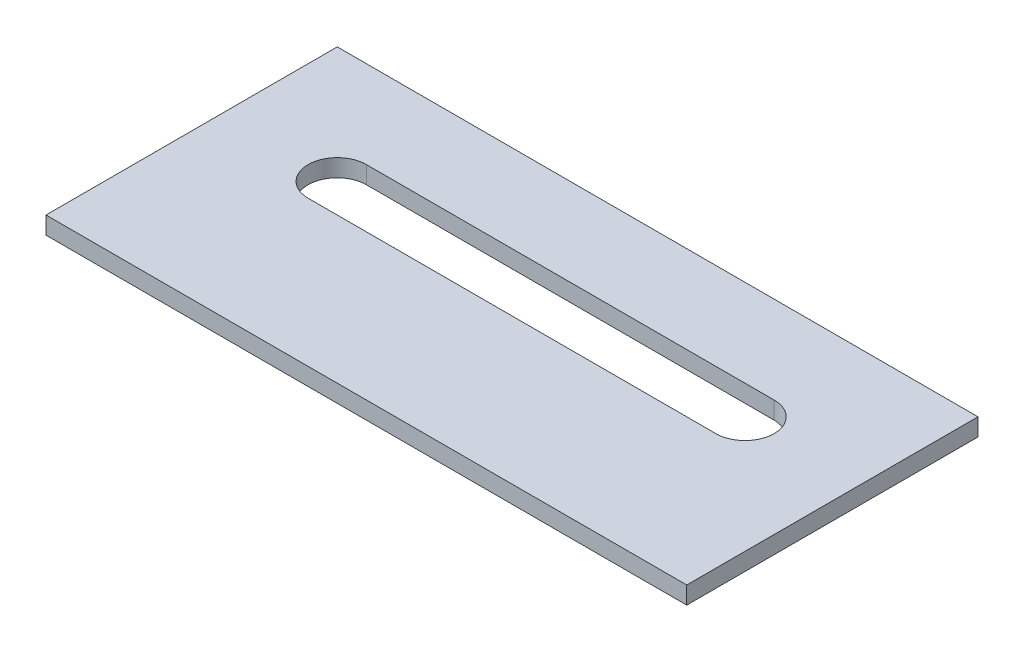
ISO-10303-21;
HEADER;
FILE_DESCRIPTION(('STEP AP214'),'2;1');
FILE_NAME('part.step','',(''),(''),'','','');
FILE_SCHEMA(('AUTOMOTIVE_DESIGN { 1 0 10303 214 1 1 1 1 }'));
ENDSEC;
DATA;
#1=APPLICATION_CONTEXT('core data for automotive mechanical design processes');
#2=APPLICATION_PROTOCOL_DEFINITION('international standard','automotive_design',2000,#1);
#3=PRODUCT_CONTEXT('',#1,'mechanical');
#4=PRODUCT('Part','Part','',(#3));
#5=PRODUCT_RELATED_PRODUCT_CATEGORY('part','',(#4));
#6=PRODUCT_DEFINITION_FORMATION('','',#4);
#7=PRODUCT_DEFINITION_CONTEXT('part definition',#1,'design');
#8=PRODUCT_DEFINITION('design','',#6,#7);
#9=PRODUCT_DEFINITION_SHAPE('','',#8);
#10=(LENGTH_UNIT() NAMED_UNIT(*) SI_UNIT(.MILLI.,.METRE.));
#11=(NAMED_UNIT(*) PLANE_ANGLE_UNIT() SI_UNIT($,.RADIAN.));
#12=(NAMED_UNIT(*) SI_UNIT($,.STERADIAN.) SOLID_ANGLE_UNIT());
#13=UNCERTAINTY_MEASURE_WITH_UNIT(LENGTH_MEASURE(1.E-05),#10,'distance_accuracy_value','');
#14=(GEOMETRIC_REPRESENTATION_CONTEXT(3) GLOBAL_UNCERTAINTY_ASSIGNED_CONTEXT((#13)) GLOBAL_UNIT_ASSIGNED_CONTEXT((#10,
#11,#12)) REPRESENTATION_CONTEXT('',''));
#15=CARTESIAN_POINT('',(0.,0.,0.));
#16=DIRECTION('',(0.,0.,1.));
#17=DIRECTION('',(1.,0.,0.));
#18=AXIS2_PLACEMENT_3D('',#15,#16,#17);
#19=CARTESIAN_POINT('',(0.,3.,0.));
#20=DIRECTION('',(0.,1.,0.));
#21=DIRECTION('',(0.,0.,1.));
#22=AXIS2_PLACEMENT_3D('',#19,#20,#21);
#23=PLANE('',#22);
#24=DIRECTION('',(0.,0.,1.));
#25=VECTOR('',#24,1.);
#26=CARTESIAN_POINT('',(0.,3.,0.));
#27=LINE('',#26,#25);
#28=CARTESIAN_POINT('',(0.,3.,0.));
#29=VERTEX_POINT('',#28);
#30=CARTESIAN_POINT('',(0.,3.,50.));
#31=VERTEX_POINT('',#30);
#32=EDGE_CURVE('E153',#29,#31,#27,.T.);
#33=ORIENTED_EDGE('',*,*,#32,.T.);
#34=DIRECTION('',(1.,0.,0.));
#35=VECTOR('',#34,1.);
#36=CARTESIAN_POINT('',(0.,3.,50.));
#37=LINE('',#36,#35);
#38=CARTESIAN_POINT('',(110.,3.,50.));
#39=VERTEX_POINT('',#38);
#40=EDGE_CURVE('E157',#31,#39,#37,.T.);
#41=ORIENTED_EDGE('',*,*,#40,.T.);
#42=DIRECTION('',(0.,0.,-1.));
#43=VECTOR('',#42,1.);
#44=CARTESIAN_POINT('',(110.,3.,0.));
#45=LINE('',#44,#43);
#46=CARTESIAN_POINT('',(110.,3.,0.));
#47=VERTEX_POINT('',#46);
#48=EDGE_CURVE('E161',#39,#47,#45,.T.);
#49=ORIENTED_EDGE('',*,*,#48,.T.);
#50=DIRECTION('',(-1.,0.,0.));
#51=VECTOR('',#50,1.);
#52=CARTESIAN_POINT('',(0.,3.,0.));
#53=LINE('',#52,#51);
#54=EDGE_CURVE('E164',#47,#29,#53,.T.);
#55=ORIENTED_EDGE('',*,*,#54,.T.);
#56=EDGE_LOOP('',(#33,#41,#49,#55));
#57=FACE_BOUND('',#56,.T.);
#58=DIRECTION('',(1.,0.,0.));
#59=VECTOR('',#58,1.);
#60=CARTESIAN_POINT('',(20.,3.,25.));
#61=LINE('',#60,#59);
#62=CARTESIAN_POINT('',(20.,3.,25.));
#63=VERTEX_POINT('',#62);
#64=CARTESIAN_POINT('',(90.,3.,25.));
#65=VERTEX_POINT('',#64);
#66=EDGE_CURVE('E114',#63,#65,#61,.T.);
#67=ORIENTED_EDGE('',*,*,#66,.F.);
#68=CARTESIAN_POINT('',(20.,3.,20.));
#69=DIRECTION('',(0.,1.,0.));
#70=DIRECTION('',(0.,0.,1.));
#71=AXIS2_PLACEMENT_3D('',#68,#69,#70);
#72=CIRCLE('',#71,5.);
#73=CARTESIAN_POINT('',(20.,3.,15.));
#74=VERTEX_POINT('',#73);
#75=EDGE_CURVE('E105',#74,#63,#72,.T.);
#76=ORIENTED_EDGE('',*,*,#75,.F.);
#77=DIRECTION('',(-1.,0.,0.));
#78=VECTOR('',#77,1.);
#79=CARTESIAN_POINT('',(20.,3.,15.));
#80=LINE('',#79,#78);
#81=CARTESIAN_POINT('',(90.,3.,15.));
#82=VERTEX_POINT('',#81);
#83=EDGE_CURVE('E131',#82,#74,#80,.T.);
#84=ORIENTED_EDGE('',*,*,#83,.F.);
#85=CARTESIAN_POINT('',(90.,3.,20.));
#86=DIRECTION('',(0.,1.,0.));
#87=DIRECTION('',(0.,0.,1.));
#88=AXIS2_PLACEMENT_3D('',#85,#86,#87);
#89=CIRCLE('',#88,5.);
#90=EDGE_CURVE('E127',#65,#82,#89,.T.);
#91=ORIENTED_EDGE('',*,*,#90,.F.);
#92=EDGE_LOOP('',(#67,#76,#84,#91));
#93=FACE_BOUND('',#92,.T.);
#94=ADVANCED_FACE('F39',(#57,#93),#23,.T.);
#95=CARTESIAN_POINT('',(0.,0.,0.));
#96=DIRECTION('',(0.,1.,0.));
#97=DIRECTION('',(0.,0.,1.));
#98=AXIS2_PLACEMENT_3D('',#95,#96,#97);
#99=PLANE('',#98);
#100=DIRECTION('',(0.,0.,1.));
#101=VECTOR('',#100,1.);
#102=CARTESIAN_POINT('',(0.,0.,0.));
#103=LINE('',#102,#101);
#104=CARTESIAN_POINT('',(0.,0.,0.));
#105=VERTEX_POINT('',#104);
#106=CARTESIAN_POINT('',(0.,0.,50.));
#107=VERTEX_POINT('',#106);
#108=EDGE_CURVE('E123',#105,#107,#103,.T.);
#109=ORIENTED_EDGE('',*,*,#108,.F.);
#110=DIRECTION('',(-1.,0.,0.));
#111=VECTOR('',#110,1.);
#112=CARTESIAN_POINT('',(0.,0.,0.));
#113=LINE('',#112,#111);
#114=CARTESIAN_POINT('',(110.,0.,0.));
#115=VERTEX_POINT('',#114);
#116=EDGE_CURVE('E158',#115,#105,#113,.T.);
#117=ORIENTED_EDGE('',*,*,#116,.F.);
#118=DIRECTION('',(0.,0.,-1.));
#119=VECTOR('',#118,1.);
#120=CARTESIAN_POINT('',(110.,0.,0.));
#121=LINE('',#120,#119);
#122=CARTESIAN_POINT('',(110.,0.,50.));
#123=VERTEX_POINT('',#122);
#124=EDGE_CURVE('E174',#123,#115,#121,.T.);
#125=ORIENTED_EDGE('',*,*,#124,.F.);
#126=DIRECTION('',(1.,0.,0.));
#127=VECTOR('',#126,1.);
#128=CARTESIAN_POINT('',(0.,0.,50.));
#129=LINE('',#128,#127);
#130=EDGE_CURVE('E171',#107,#123,#129,.T.);
#131=ORIENTED_EDGE('',*,*,#130,.F.);
#132=EDGE_LOOP('',(#109,#117,#125,#131));
#133=FACE_BOUND('',#132,.T.);
#134=CARTESIAN_POINT('',(20.,0.,20.));
#135=DIRECTION('',(0.,1.,0.));
#136=DIRECTION('',(0.,0.,1.));
#137=AXIS2_PLACEMENT_3D('',#134,#135,#136);
#138=CIRCLE('',#137,5.);
#139=CARTESIAN_POINT('',(20.,0.,15.));
#140=VERTEX_POINT('',#139);
#141=CARTESIAN_POINT('',(20.,0.,25.));
#142=VERTEX_POINT('',#141);
#143=EDGE_CURVE('E63',#140,#142,#138,.T.);
#144=ORIENTED_EDGE('',*,*,#143,.T.);
#145=DIRECTION('',(1.,0.,0.));
#146=VECTOR('',#145,1.);
#147=CARTESIAN_POINT('',(20.,0.,25.));
#148=LINE('',#147,#146);
#149=CARTESIAN_POINT('',(90.,0.,25.));
#150=VERTEX_POINT('',#149);
#151=EDGE_CURVE('E121',#142,#150,#148,.T.);
#152=ORIENTED_EDGE('',*,*,#151,.T.);
#153=CARTESIAN_POINT('',(90.,0.,20.));
#154=DIRECTION('',(0.,1.,0.));
#155=DIRECTION('',(0.,0.,1.));
#156=AXIS2_PLACEMENT_3D('',#153,#154,#155);
#157=CIRCLE('',#156,5.);
#158=CARTESIAN_POINT('',(90.,0.,15.));
#159=VERTEX_POINT('',#158);
#160=EDGE_CURVE('E140',#150,#159,#157,.T.);
#161=ORIENTED_EDGE('',*,*,#160,.T.);
#162=DIRECTION('',(-1.,0.,0.));
#163=VECTOR('',#162,1.);
#164=CARTESIAN_POINT('',(20.,0.,15.));
#165=LINE('',#164,#163);
#166=EDGE_CURVE('E115',#159,#140,#165,.T.);
#167=ORIENTED_EDGE('',*,*,#166,.T.);
#168=EDGE_LOOP('',(#144,#152,#161,#167));
#169=FACE_BOUND('',#168,.T.);
#170=ADVANCED_FACE('F197',(#133,#169),#99,.F.);
#171=CARTESIAN_POINT('',(0.,3.,0.));
#172=DIRECTION('',(1.,0.,0.));
#173=DIRECTION('',(0.,0.,-1.));
#174=AXIS2_PLACEMENT_3D('',#171,#172,#173);
#175=PLANE('',#174);
#176=ORIENTED_EDGE('',*,*,#108,.T.);
#177=DIRECTION('',(0.,-1.,0.));
#178=VECTOR('',#177,1.);
#179=CARTESIAN_POINT('',(0.,3.,50.));
#180=LINE('',#179,#178);
#181=EDGE_CURVE('E11',#31,#107,#180,.T.);
#182=ORIENTED_EDGE('',*,*,#181,.F.);
#183=ORIENTED_EDGE('',*,*,#32,.F.);
#184=DIRECTION('',(0.,-1.,0.));
#185=VECTOR('',#184,1.);
#186=CARTESIAN_POINT('',(0.,3.,0.));
#187=LINE('',#186,#185);
#188=EDGE_CURVE('E167',#29,#105,#187,.T.);
#189=ORIENTED_EDGE('',*,*,#188,.T.);
#190=EDGE_LOOP('',(#176,#182,#183,#189));
#191=FACE_BOUND('',#190,.T.);
#192=ADVANCED_FACE('F41',(#191),#175,.F.);
#193=CARTESIAN_POINT('',(0.,3.,50.));
#194=DIRECTION('',(0.,0.,-1.));
#195=DIRECTION('',(-1.,0.,0.));
#196=AXIS2_PLACEMENT_3D('',#193,#194,#195);
#197=PLANE('',#196);
#198=ORIENTED_EDGE('',*,*,#130,.T.);
#199=DIRECTION('',(0.,-1.,0.));
#200=VECTOR('',#199,1.);
#201=CARTESIAN_POINT('',(110.,3.,50.));
#202=LINE('',#201,#200);
#203=EDGE_CURVE('E48',#39,#123,#202,.T.);
#204=ORIENTED_EDGE('',*,*,#203,.F.);
#205=ORIENTED_EDGE('',*,*,#40,.F.);
#206=ORIENTED_EDGE('',*,*,#181,.T.);
#207=EDGE_LOOP('',(#198,#204,#205,#206));
#208=FACE_BOUND('',#207,.T.);
#209=ADVANCED_FACE('F207',(#208),#197,.F.);
#210=CARTESIAN_POINT('',(110.,3.,0.));
#211=DIRECTION('',(-1.,0.,0.));
#212=DIRECTION('',(0.,0.,1.));
#213=AXIS2_PLACEMENT_3D('',#210,#211,#212);
#214=PLANE('',#213);
#215=ORIENTED_EDGE('',*,*,#124,.T.);
#216=DIRECTION('',(0.,-1.,0.));
#217=VECTOR('',#216,1.);
#218=CARTESIAN_POINT('',(110.,3.,0.));
#219=LINE('',#218,#217);
#220=EDGE_CURVE('E182',#47,#115,#219,.T.);
#221=ORIENTED_EDGE('',*,*,#220,.F.);
#222=ORIENTED_EDGE('',*,*,#48,.F.);
#223=ORIENTED_EDGE('',*,*,#203,.T.);
#224=EDGE_LOOP('',(#215,#221,#222,#223));
#225=FACE_BOUND('',#224,.T.);
#226=ADVANCED_FACE('F191',(#225),#214,.F.);
#227=CARTESIAN_POINT('',(0.,3.,0.));
#228=DIRECTION('',(0.,0.,1.));
#229=DIRECTION('',(1.,0.,0.));
#230=AXIS2_PLACEMENT_3D('',#227,#228,#229);
#231=PLANE('',#230);
#232=ORIENTED_EDGE('',*,*,#116,.T.);
#233=ORIENTED_EDGE('',*,*,#188,.F.);
#234=ORIENTED_EDGE('',*,*,#54,.F.);
#235=ORIENTED_EDGE('',*,*,#220,.T.);
#236=EDGE_LOOP('',(#232,#233,#234,#235));
#237=FACE_BOUND('',#236,.T.);
#238=ADVANCED_FACE('F201',(#237),#231,.F.);
#239=CARTESIAN_POINT('',(20.,3.,20.));
#240=DIRECTION('',(0.,-1.,0.));
#241=DIRECTION('',(0.,0.,-1.));
#242=AXIS2_PLACEMENT_3D('',#239,#240,#241);
#243=CYLINDRICAL_SURFACE('',#242,5.);
#244=ORIENTED_EDGE('',*,*,#143,.F.);
#245=DIRECTION('',(0.,-1.,0.));
#246=VECTOR('',#245,1.);
#247=CARTESIAN_POINT('',(20.,3.,15.));
#248=LINE('',#247,#246);
#249=EDGE_CURVE('E109',#74,#140,#248,.T.);
#250=ORIENTED_EDGE('',*,*,#249,.F.);
#251=ORIENTED_EDGE('',*,*,#75,.T.);
#252=DIRECTION('',(0.,-1.,0.));
#253=VECTOR('',#252,1.);
#254=CARTESIAN_POINT('',(20.,3.,25.));
#255=LINE('',#254,#253);
#256=EDGE_CURVE('E108',#63,#142,#255,.T.);
#257=ORIENTED_EDGE('',*,*,#256,.T.);
#258=EDGE_LOOP('',(#244,#250,#251,#257));
#259=FACE_BOUND('',#258,.T.);
#260=ADVANCED_FACE('F107',(#259),#243,.F.);
#261=CARTESIAN_POINT('',(20.,3.,25.));
#262=DIRECTION('',(0.,0.,-1.));
#263=DIRECTION('',(-1.,0.,0.));
#264=AXIS2_PLACEMENT_3D('',#261,#262,#263);
#265=PLANE('',#264);
#266=ORIENTED_EDGE('',*,*,#151,.F.);
#267=ORIENTED_EDGE('',*,*,#256,.F.);
#268=ORIENTED_EDGE('',*,*,#66,.T.);
#269=DIRECTION('',(0.,-1.,0.));
#270=VECTOR('',#269,1.);
#271=CARTESIAN_POINT('',(90.,3.,25.));
#272=LINE('',#271,#270);
#273=EDGE_CURVE('E124',#65,#150,#272,.T.);
#274=ORIENTED_EDGE('',*,*,#273,.T.);
#275=EDGE_LOOP('',(#266,#267,#268,#274));
#276=FACE_BOUND('',#275,.T.);
#277=ADVANCED_FACE('F118',(#276),#265,.T.);
#278=CARTESIAN_POINT('',(90.,3.,20.));
#279=DIRECTION('',(0.,-1.,0.));
#280=DIRECTION('',(0.,0.,-1.));
#281=AXIS2_PLACEMENT_3D('',#278,#279,#280);
#282=CYLINDRICAL_SURFACE('',#281,5.);
#283=ORIENTED_EDGE('',*,*,#160,.F.);
#284=ORIENTED_EDGE('',*,*,#273,.F.);
#285=ORIENTED_EDGE('',*,*,#90,.T.);
#286=DIRECTION('',(0.,-1.,0.));
#287=VECTOR('',#286,1.);
#288=CARTESIAN_POINT('',(90.,3.,15.));
#289=LINE('',#288,#287);
#290=EDGE_CURVE('E55',#82,#159,#289,.T.);
#291=ORIENTED_EDGE('',*,*,#290,.T.);
#292=EDGE_LOOP('',(#283,#284,#285,#291));
#293=FACE_BOUND('',#292,.T.);
#294=ADVANCED_FACE('F230',(#293),#282,.F.);
#295=CARTESIAN_POINT('',(20.,3.,15.));
#296=DIRECTION('',(0.,0.,1.));
#297=DIRECTION('',(1.,0.,0.));
#298=AXIS2_PLACEMENT_3D('',#295,#296,#297);
#299=PLANE('',#298);
#300=ORIENTED_EDGE('',*,*,#166,.F.);
#301=ORIENTED_EDGE('',*,*,#290,.F.);
#302=ORIENTED_EDGE('',*,*,#83,.T.);
#303=ORIENTED_EDGE('',*,*,#249,.T.);
#304=EDGE_LOOP('',(#300,#301,#302,#303));
#305=FACE_BOUND('',#304,.T.);
#306=ADVANCED_FACE('F234',(#305),#299,.T.);
#307=CLOSED_SHELL('',(#94,#170,#192,#209,#226,#238,#260,#277,#294,#306));
#308=MANIFOLD_SOLID_BREP('B2',#307);
#309=ADVANCED_BREP_SHAPE_REPRESENTATION('',(#18,#308),#14);
#310=SHAPE_DEFINITION_REPRESENTATION(#9,#309);
ENDSEC;
END-ISO-10303-21;
